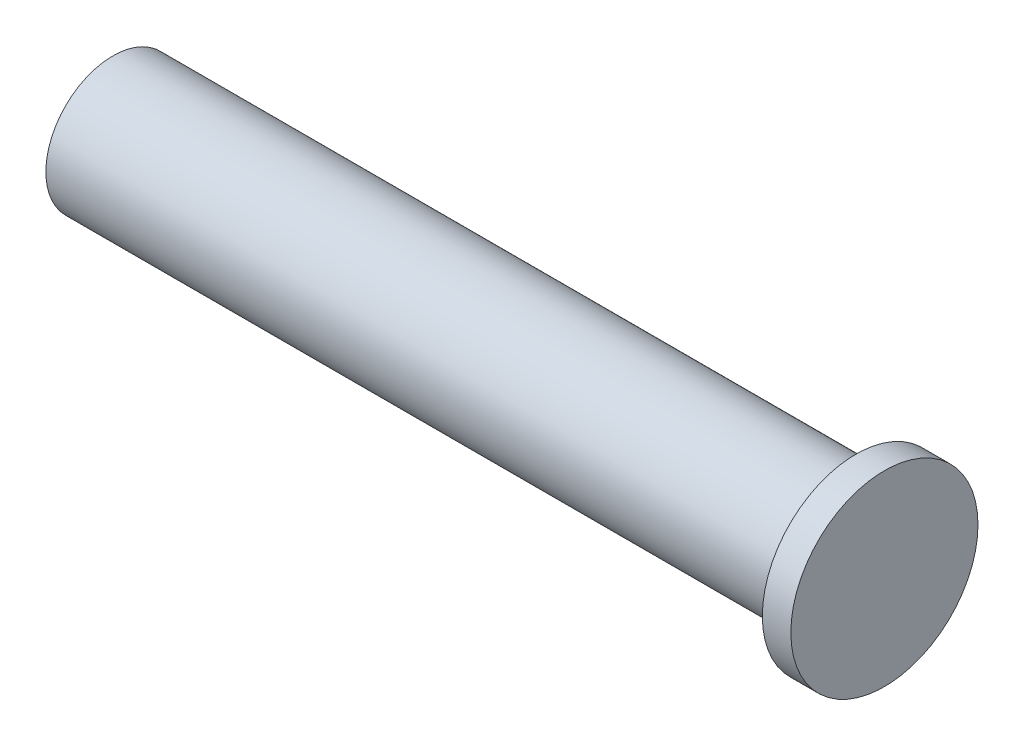
ISO-10303-21;
HEADER;
FILE_DESCRIPTION(('STEP AP214'),'2;1');
FILE_NAME('part.step','',(''),(''),'','','');
FILE_SCHEMA(('AUTOMOTIVE_DESIGN { 1 0 10303 214 1 1 1 1 }'));
ENDSEC;
DATA;
#1=APPLICATION_CONTEXT('core data for automotive mechanical design processes');
#2=APPLICATION_PROTOCOL_DEFINITION('international standard','automotive_design',2000,#1);
#3=PRODUCT_CONTEXT('',#1,'mechanical');
#4=PRODUCT('Part','Part','',(#3));
#5=PRODUCT_RELATED_PRODUCT_CATEGORY('part','',(#4));
#6=PRODUCT_DEFINITION_FORMATION('','',#4);
#7=PRODUCT_DEFINITION_CONTEXT('part definition',#1,'design');
#8=PRODUCT_DEFINITION('design','',#6,#7);
#9=PRODUCT_DEFINITION_SHAPE('','',#8);
#10=(LENGTH_UNIT() NAMED_UNIT(*) SI_UNIT(.MILLI.,.METRE.));
#11=(NAMED_UNIT(*) PLANE_ANGLE_UNIT() SI_UNIT($,.RADIAN.));
#12=(NAMED_UNIT(*) SI_UNIT($,.STERADIAN.) SOLID_ANGLE_UNIT());
#13=UNCERTAINTY_MEASURE_WITH_UNIT(LENGTH_MEASURE(1.E-05),#10,'distance_accuracy_value','');
#14=(GEOMETRIC_REPRESENTATION_CONTEXT(3) GLOBAL_UNCERTAINTY_ASSIGNED_CONTEXT((#13)) GLOBAL_UNIT_ASSIGNED_CONTEXT((#10,
#11,#12)) REPRESENTATION_CONTEXT('',''));
#15=CARTESIAN_POINT('',(0.,0.,0.));
#16=DIRECTION('',(0.,0.,1.));
#17=DIRECTION('',(1.,0.,0.));
#18=AXIS2_PLACEMENT_3D('',#15,#16,#17);
#19=CARTESIAN_POINT('',(20.9931,0.,3.937));
#20=DIRECTION('',(1.,0.,0.));
#21=DIRECTION('',(0.,0.,-1.));
#22=AXIS2_PLACEMENT_3D('',#19,#20,#21);
#23=PLANE('',#22);
#24=CARTESIAN_POINT('',(20.9931,0.,0.));
#25=DIRECTION('',(1.,0.,0.));
#26=DIRECTION('',(0.,0.,-1.));
#27=AXIS2_PLACEMENT_3D('',#24,#25,#26);
#28=CIRCLE('',#27,5.49909999999999);
#29=CARTESIAN_POINT('',(20.9931,0.,-5.49909999999999));
#30=VERTEX_POINT('',#29);
#31=EDGE_CURVE('E10',#30,#30,#28,.T.);
#32=ORIENTED_EDGE('',*,*,#31,.F.);
#33=EDGE_LOOP('',(#32));
#34=FACE_BOUND('',#33,.T.);
#35=CARTESIAN_POINT('',(20.9931,0.,0.));
#36=DIRECTION('',(1.,0.,0.));
#37=DIRECTION('',(0.,0.,-1.));
#38=AXIS2_PLACEMENT_3D('',#35,#36,#37);
#39=CIRCLE('',#38,3.937);
#40=CARTESIAN_POINT('',(20.9931,0.,-3.937));
#41=VERTEX_POINT('',#40);
#42=EDGE_CURVE('E45',#41,#41,#39,.T.);
#43=ORIENTED_EDGE('',*,*,#42,.T.);
#44=EDGE_LOOP('',(#43));
#45=FACE_BOUND('',#44,.T.);
#46=ADVANCED_FACE('F31',(#34,#45),#23,.F.);
#47=CARTESIAN_POINT('',(22.6695,0.,0.));
#48=DIRECTION('',(1.,0.,0.));
#49=DIRECTION('',(0.,0.,-1.));
#50=AXIS2_PLACEMENT_3D('',#47,#48,#49);
#51=CYLINDRICAL_SURFACE('',#50,5.49909999999999);
#52=CARTESIAN_POINT('',(22.6695,0.,0.));
#53=DIRECTION('',(1.,0.,0.));
#54=DIRECTION('',(0.,0.,-1.));
#55=AXIS2_PLACEMENT_3D('',#52,#53,#54);
#56=CIRCLE('',#55,5.49909999999999);
#57=CARTESIAN_POINT('',(22.6695,0.,-5.49909999999999));
#58=VERTEX_POINT('',#57);
#59=EDGE_CURVE('E37',#58,#58,#56,.T.);
#60=ORIENTED_EDGE('',*,*,#59,.F.);
#61=EDGE_LOOP('',(#60));
#62=FACE_BOUND('',#61,.T.);
#63=ORIENTED_EDGE('',*,*,#31,.T.);
#64=EDGE_LOOP('',(#63));
#65=FACE_BOUND('',#64,.T.);
#66=ADVANCED_FACE('F65',(#62,#65),#51,.T.);
#67=CARTESIAN_POINT('',(22.6695,0.,5.49909999999999));
#68=DIRECTION('',(-1.,0.,0.));
#69=DIRECTION('',(0.,0.,1.));
#70=AXIS2_PLACEMENT_3D('',#67,#68,#69);
#71=PLANE('',#70);
#72=ORIENTED_EDGE('',*,*,#59,.T.);
#73=EDGE_LOOP('',(#72));
#74=FACE_BOUND('',#73,.T.);
#75=ADVANCED_FACE('F60',(#74),#71,.F.);
#76=CARTESIAN_POINT('',(-22.6695,0.,0.));
#77=DIRECTION('',(1.,0.,0.));
#78=DIRECTION('',(0.,0.,-1.));
#79=AXIS2_PLACEMENT_3D('',#76,#77,#78);
#80=PLANE('',#79);
#81=CARTESIAN_POINT('',(-22.6695,0.,0.));
#82=DIRECTION('',(1.,0.,0.));
#83=DIRECTION('',(0.,0.,-1.));
#84=AXIS2_PLACEMENT_3D('',#81,#82,#83);
#85=CIRCLE('',#84,3.93699999999999);
#86=CARTESIAN_POINT('',(-22.6695,0.,-3.93699999999998));
#87=VERTEX_POINT('',#86);
#88=EDGE_CURVE('E41',#87,#87,#85,.T.);
#89=ORIENTED_EDGE('',*,*,#88,.F.);
#90=EDGE_LOOP('',(#89));
#91=FACE_BOUND('',#90,.T.);
#92=ADVANCED_FACE('F55',(#91),#80,.F.);
#93=CARTESIAN_POINT('',(22.6695,0.,0.));
#94=DIRECTION('',(1.,0.,0.));
#95=DIRECTION('',(0.,0.,-1.));
#96=AXIS2_PLACEMENT_3D('',#93,#94,#95);
#97=CYLINDRICAL_SURFACE('',#96,3.937);
#98=ORIENTED_EDGE('',*,*,#42,.F.);
#99=EDGE_LOOP('',(#98));
#100=FACE_BOUND('',#99,.T.);
#101=ORIENTED_EDGE('',*,*,#88,.T.);
#102=EDGE_LOOP('',(#101));
#103=FACE_BOUND('',#102,.T.);
#104=ADVANCED_FACE('F52',(#100,#103),#97,.T.);
#105=CLOSED_SHELL('',(#46,#66,#75,#92,#104));
#106=MANIFOLD_SOLID_BREP('B2',#105);
#107=ADVANCED_BREP_SHAPE_REPRESENTATION('',(#18,#106),#14);
#108=SHAPE_DEFINITION_REPRESENTATION(#9,#107);
ENDSEC;
END-ISO-10303-21;
